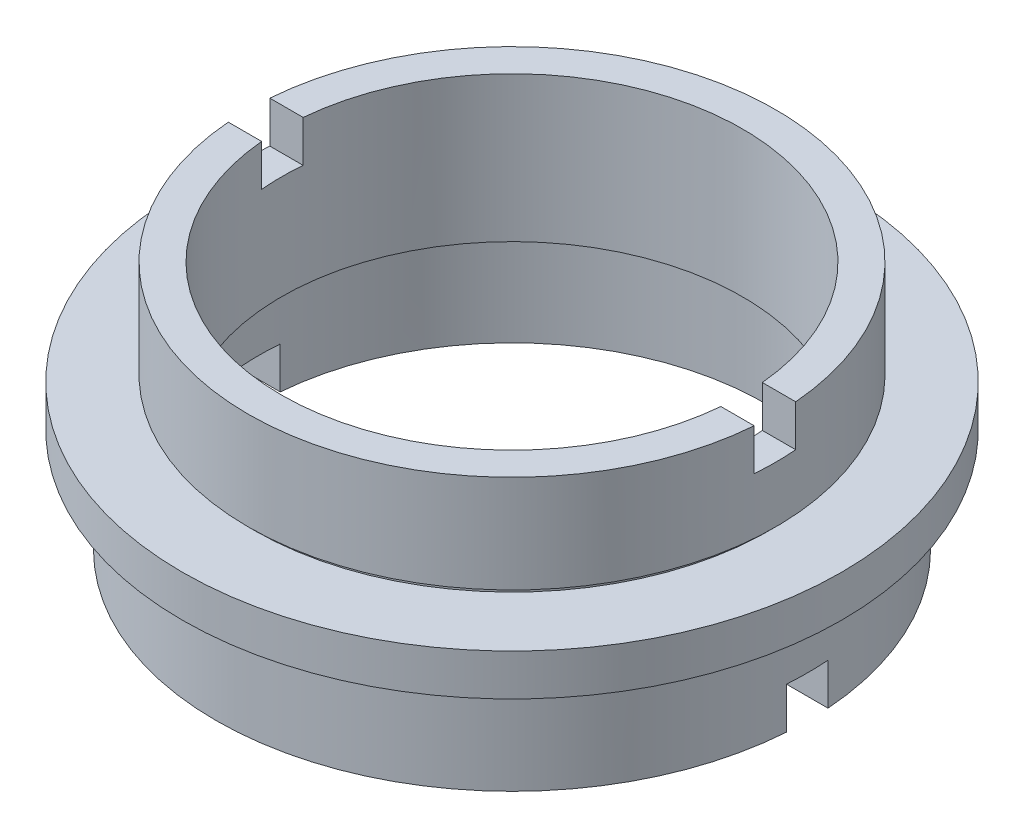
ISO-10303-21;
HEADER;
FILE_DESCRIPTION(('STEP AP214'),'2;1');
FILE_NAME('part.step','',(''),(''),'','','');
FILE_SCHEMA(('AUTOMOTIVE_DESIGN { 1 0 10303 214 1 1 1 1 }'));
ENDSEC;
DATA;
#1=APPLICATION_CONTEXT('core data for automotive mechanical design processes');
#2=APPLICATION_PROTOCOL_DEFINITION('international standard','automotive_design',2000,#1);
#3=PRODUCT_CONTEXT('',#1,'mechanical');
#4=PRODUCT('Part','Part','',(#3));
#5=PRODUCT_RELATED_PRODUCT_CATEGORY('part','',(#4));
#6=PRODUCT_DEFINITION_FORMATION('','',#4);
#7=PRODUCT_DEFINITION_CONTEXT('part definition',#1,'design');
#8=PRODUCT_DEFINITION('design','',#6,#7);
#9=PRODUCT_DEFINITION_SHAPE('','',#8);
#10=(LENGTH_UNIT() NAMED_UNIT(*) SI_UNIT(.MILLI.,.METRE.));
#11=(NAMED_UNIT(*) PLANE_ANGLE_UNIT() SI_UNIT($,.RADIAN.));
#12=(NAMED_UNIT(*) SI_UNIT($,.STERADIAN.) SOLID_ANGLE_UNIT());
#13=UNCERTAINTY_MEASURE_WITH_UNIT(LENGTH_MEASURE(1.E-05),#10,'distance_accuracy_value','');
#14=(GEOMETRIC_REPRESENTATION_CONTEXT(3) GLOBAL_UNCERTAINTY_ASSIGNED_CONTEXT((#13)) GLOBAL_UNIT_ASSIGNED_CONTEXT((#10,
#11,#12)) REPRESENTATION_CONTEXT('',''));
#15=CARTESIAN_POINT('',(0.,0.,0.));
#16=DIRECTION('',(0.,0.,1.));
#17=DIRECTION('',(1.,0.,0.));
#18=AXIS2_PLACEMENT_3D('',#15,#16,#17);
#19=CARTESIAN_POINT('',(-14.25,0.,0.));
#20=DIRECTION('',(0.,-1.,0.));
#21=DIRECTION('',(0.,0.,-1.));
#22=AXIS2_PLACEMENT_3D('',#19,#20,#21);
#23=PLANE('',#22);
#24=DIRECTION('',(-1.,0.,0.));
#25=VECTOR('',#24,1.);
#26=CARTESIAN_POINT('',(-14.25,0.,1.));
#27=LINE('',#26,#25);
#28=CARTESIAN_POINT('',(14.2148689758295,0.,1.));
#29=VERTEX_POINT('',#28);
#30=CARTESIAN_POINT('',(12.1589473228565,0.,1.));
#31=VERTEX_POINT('',#30);
#32=EDGE_CURVE('E183',#29,#31,#27,.T.);
#33=ORIENTED_EDGE('',*,*,#32,.F.);
#34=CARTESIAN_POINT('',(0.,0.,0.));
#35=DIRECTION('',(0.,1.,0.));
#36=DIRECTION('',(0.,0.,1.));
#37=AXIS2_PLACEMENT_3D('',#34,#35,#36);
#38=CIRCLE('',#37,14.25);
#39=CARTESIAN_POINT('',(-14.2148689758295,0.,1.));
#40=VERTEX_POINT('',#39);
#41=EDGE_CURVE('E238',#40,#29,#38,.T.);
#42=ORIENTED_EDGE('',*,*,#41,.F.);
#43=CARTESIAN_POINT('',(-12.1589473228565,0.,1.));
#44=VERTEX_POINT('',#43);
#45=EDGE_CURVE('E161',#44,#40,#27,.T.);
#46=ORIENTED_EDGE('',*,*,#45,.F.);
#47=CARTESIAN_POINT('',(0.,0.,0.));
#48=DIRECTION('',(0.,1.,0.));
#49=DIRECTION('',(0.,0.,1.));
#50=AXIS2_PLACEMENT_3D('',#47,#48,#49);
#51=CIRCLE('',#50,12.2);
#52=EDGE_CURVE('E234',#44,#31,#51,.T.);
#53=ORIENTED_EDGE('',*,*,#52,.T.);
#54=EDGE_LOOP('',(#33,#42,#46,#53));
#55=FACE_BOUND('',#54,.T.);
#56=ADVANCED_FACE('F38',(#55),#23,.T.);
#57=CARTESIAN_POINT('',(-11.1,12.,0.));
#58=DIRECTION('',(0.,1.,0.));
#59=DIRECTION('',(0.,0.,1.));
#60=AXIS2_PLACEMENT_3D('',#57,#58,#59);
#61=PLANE('',#60);
#62=DIRECTION('',(1.,0.,0.));
#63=VECTOR('',#62,1.);
#64=CARTESIAN_POINT('',(-11.1,12.,1.));
#65=LINE('',#64,#63);
#66=CARTESIAN_POINT('',(-12.6605687076055,12.,1.));
#67=VERTEX_POINT('',#66);
#68=CARTESIAN_POINT('',(-11.054863183233,12.,1.));
#69=VERTEX_POINT('',#68);
#70=EDGE_CURVE('E270',#67,#69,#65,.T.);
#71=ORIENTED_EDGE('',*,*,#70,.F.);
#72=CARTESIAN_POINT('',(0.,12.,0.));
#73=DIRECTION('',(0.,1.,0.));
#74=DIRECTION('',(0.,0.,1.));
#75=AXIS2_PLACEMENT_3D('',#72,#73,#74);
#76=CIRCLE('',#75,12.7);
#77=CARTESIAN_POINT('',(12.6605687076055,12.,1.));
#78=VERTEX_POINT('',#77);
#79=EDGE_CURVE('E214',#67,#78,#76,.T.);
#80=ORIENTED_EDGE('',*,*,#79,.T.);
#81=CARTESIAN_POINT('',(11.054863183233,12.,1.));
#82=VERTEX_POINT('',#81);
#83=EDGE_CURVE('E268',#82,#78,#65,.T.);
#84=ORIENTED_EDGE('',*,*,#83,.F.);
#85=CARTESIAN_POINT('',(0.,12.,0.));
#86=DIRECTION('',(0.,1.,0.));
#87=DIRECTION('',(0.,0.,1.));
#88=AXIS2_PLACEMENT_3D('',#85,#86,#87);
#89=CIRCLE('',#88,11.1);
#90=EDGE_CURVE('E218',#69,#82,#89,.T.);
#91=ORIENTED_EDGE('',*,*,#90,.F.);
#92=EDGE_LOOP('',(#71,#80,#84,#91));
#93=FACE_BOUND('',#92,.T.);
#94=ADVANCED_FACE('F319',(#93),#61,.T.);
#95=CARTESIAN_POINT('',(0.,22.6774994510759,0.));
#96=DIRECTION('',(0.,1.,0.));
#97=DIRECTION('',(0.,0.,1.));
#98=AXIS2_PLACEMENT_3D('',#95,#96,#97);
#99=CYLINDRICAL_SURFACE('',#98,12.7);
#100=DIRECTION('',(0.,1.,0.));
#101=VECTOR('',#100,1.);
#102=CARTESIAN_POINT('',(-12.6605687076055,22.6774994510759,1.));
#103=LINE('',#102,#101);
#104=CARTESIAN_POINT('',(-12.6605687076055,10.,1.));
#105=VERTEX_POINT('',#104);
#106=EDGE_CURVE('E209',#105,#67,#103,.T.);
#107=ORIENTED_EDGE('',*,*,#106,.F.);
#108=CARTESIAN_POINT('',(0.,10.,0.));
#109=DIRECTION('',(0.,-1.,0.));
#110=DIRECTION('',(0.,0.,-1.));
#111=AXIS2_PLACEMENT_3D('',#108,#109,#110);
#112=CIRCLE('',#111,12.7);
#113=CARTESIAN_POINT('',(-12.6605687076055,10.,-0.999999999999997));
#114=VERTEX_POINT('',#113);
#115=EDGE_CURVE('E213',#114,#105,#112,.F.);
#116=ORIENTED_EDGE('',*,*,#115,.F.);
#117=DIRECTION('',(0.,1.,0.));
#118=VECTOR('',#117,1.);
#119=CARTESIAN_POINT('',(-12.6605687076055,22.6774994510759,-1.));
#120=LINE('',#119,#118);
#121=CARTESIAN_POINT('',(-12.6605687076055,12.,-0.999999999999998));
#122=VERTEX_POINT('',#121);
#123=EDGE_CURVE('E197',#122,#114,#120,.F.);
#124=ORIENTED_EDGE('',*,*,#123,.F.);
#125=CARTESIAN_POINT('',(12.6605687076055,12.,-0.999999999999998));
#126=VERTEX_POINT('',#125);
#127=EDGE_CURVE('E217',#126,#122,#76,.T.);
#128=ORIENTED_EDGE('',*,*,#127,.F.);
#129=DIRECTION('',(0.,1.,0.));
#130=VECTOR('',#129,1.);
#131=CARTESIAN_POINT('',(12.6605687076055,22.6774994510759,-1.));
#132=LINE('',#131,#130);
#133=CARTESIAN_POINT('',(12.6605687076055,10.,-0.999999999999997));
#134=VERTEX_POINT('',#133);
#135=EDGE_CURVE('E201',#134,#126,#132,.T.);
#136=ORIENTED_EDGE('',*,*,#135,.F.);
#137=CARTESIAN_POINT('',(12.6605687076055,10.,1.));
#138=VERTEX_POINT('',#137);
#139=EDGE_CURVE('E211',#138,#134,#112,.F.);
#140=ORIENTED_EDGE('',*,*,#139,.F.);
#141=DIRECTION('',(0.,1.,0.));
#142=VECTOR('',#141,1.);
#143=CARTESIAN_POINT('',(12.6605687076055,22.6774994510759,1.));
#144=LINE('',#143,#142);
#145=EDGE_CURVE('E205',#78,#138,#144,.F.);
#146=ORIENTED_EDGE('',*,*,#145,.F.);
#147=ORIENTED_EDGE('',*,*,#79,.F.);
#148=EDGE_LOOP('',(#107,#116,#124,#128,#136,#140,#146,#147));
#149=FACE_BOUND('',#148,.T.);
#150=CARTESIAN_POINT('',(0.,7.3,0.));
#151=DIRECTION('',(0.,1.,0.));
#152=DIRECTION('',(0.,0.,1.));
#153=AXIS2_PLACEMENT_3D('',#150,#151,#152);
#154=CIRCLE('',#153,12.7);
#155=CARTESIAN_POINT('',(0.,7.3,12.7));
#156=VERTEX_POINT('',#155);
#157=EDGE_CURVE('E262',#156,#156,#154,.T.);
#158=ORIENTED_EDGE('',*,*,#157,.T.);
#159=EDGE_LOOP('',(#158));
#160=FACE_BOUND('',#159,.T.);
#161=ADVANCED_FACE('F40',(#149,#160),#99,.T.);
#162=CARTESIAN_POINT('',(-12.7,7.3,0.));
#163=DIRECTION('',(0.,-1.,0.));
#164=DIRECTION('',(0.,0.,-1.));
#165=AXIS2_PLACEMENT_3D('',#162,#163,#164);
#166=PLANE('',#165);
#167=CARTESIAN_POINT('',(0.,7.3,0.));
#168=DIRECTION('',(0.,1.,0.));
#169=DIRECTION('',(0.,0.,1.));
#170=AXIS2_PLACEMENT_3D('',#167,#168,#169);
#171=CIRCLE('',#170,12.4);
#172=CARTESIAN_POINT('',(0.,7.3,12.4));
#173=VERTEX_POINT('',#172);
#174=EDGE_CURVE('E259',#173,#173,#171,.T.);
#175=ORIENTED_EDGE('',*,*,#174,.T.);
#176=EDGE_LOOP('',(#175));
#177=FACE_BOUND('',#176,.T.);
#178=ORIENTED_EDGE('',*,*,#157,.F.);
#179=EDGE_LOOP('',(#178));
#180=FACE_BOUND('',#179,.T.);
#181=ADVANCED_FACE('F329',(#177,#180),#166,.T.);
#182=CARTESIAN_POINT('',(0.,22.6774994510759,0.));
#183=DIRECTION('',(0.,1.,0.));
#184=DIRECTION('',(0.,0.,1.));
#185=AXIS2_PLACEMENT_3D('',#182,#183,#184);
#186=CYLINDRICAL_SURFACE('',#185,12.4);
#187=CARTESIAN_POINT('',(0.,7.,0.));
#188=DIRECTION('',(0.,1.,0.));
#189=DIRECTION('',(0.,0.,1.));
#190=AXIS2_PLACEMENT_3D('',#187,#188,#189);
#191=CIRCLE('',#190,12.4);
#192=CARTESIAN_POINT('',(0.,7.,12.4));
#193=VERTEX_POINT('',#192);
#194=EDGE_CURVE('E256',#193,#193,#191,.T.);
#195=ORIENTED_EDGE('',*,*,#194,.T.);
#196=EDGE_LOOP('',(#195));
#197=FACE_BOUND('',#196,.T.);
#198=ORIENTED_EDGE('',*,*,#174,.F.);
#199=EDGE_LOOP('',(#198));
#200=FACE_BOUND('',#199,.T.);
#201=ADVANCED_FACE('F569',(#197,#200),#186,.T.);
#202=CARTESIAN_POINT('',(-12.4,7.,0.));
#203=DIRECTION('',(0.,1.,0.));
#204=DIRECTION('',(0.,0.,1.));
#205=AXIS2_PLACEMENT_3D('',#202,#203,#204);
#206=PLANE('',#205);
#207=CARTESIAN_POINT('',(0.,7.,0.));
#208=DIRECTION('',(0.,1.,0.));
#209=DIRECTION('',(0.,0.,1.));
#210=AXIS2_PLACEMENT_3D('',#207,#208,#209);
#211=CIRCLE('',#210,15.875);
#212=CARTESIAN_POINT('',(0.,7.,15.875));
#213=VERTEX_POINT('',#212);
#214=EDGE_CURVE('E253',#213,#213,#211,.T.);
#215=ORIENTED_EDGE('',*,*,#214,.T.);
#216=EDGE_LOOP('',(#215));
#217=FACE_BOUND('',#216,.T.);
#218=ORIENTED_EDGE('',*,*,#194,.F.);
#219=EDGE_LOOP('',(#218));
#220=FACE_BOUND('',#219,.T.);
#221=ADVANCED_FACE('F560',(#217,#220),#206,.T.);
#222=CARTESIAN_POINT('',(0.,22.6774994510759,0.));
#223=DIRECTION('',(0.,1.,0.));
#224=DIRECTION('',(0.,0.,1.));
#225=AXIS2_PLACEMENT_3D('',#222,#223,#224);
#226=CYLINDRICAL_SURFACE('',#225,15.875);
#227=CARTESIAN_POINT('',(0.,5.,0.));
#228=DIRECTION('',(0.,1.,0.));
#229=DIRECTION('',(0.,0.,1.));
#230=AXIS2_PLACEMENT_3D('',#227,#228,#229);
#231=CIRCLE('',#230,15.875);
#232=CARTESIAN_POINT('',(0.,5.,15.875));
#233=VERTEX_POINT('',#232);
#234=EDGE_CURVE('E250',#233,#233,#231,.T.);
#235=ORIENTED_EDGE('',*,*,#234,.T.);
#236=EDGE_LOOP('',(#235));
#237=FACE_BOUND('',#236,.T.);
#238=ORIENTED_EDGE('',*,*,#214,.F.);
#239=EDGE_LOOP('',(#238));
#240=FACE_BOUND('',#239,.T.);
#241=ADVANCED_FACE('F551',(#237,#240),#226,.T.);
#242=CARTESIAN_POINT('',(-15.875,5.,0.));
#243=DIRECTION('',(0.,-1.,0.));
#244=DIRECTION('',(0.,0.,-1.));
#245=AXIS2_PLACEMENT_3D('',#242,#243,#244);
#246=PLANE('',#245);
#247=CARTESIAN_POINT('',(0.,5.,0.));
#248=DIRECTION('',(0.,1.,0.));
#249=DIRECTION('',(0.,0.,1.));
#250=AXIS2_PLACEMENT_3D('',#247,#248,#249);
#251=CIRCLE('',#250,13.75);
#252=CARTESIAN_POINT('',(0.,5.,13.75));
#253=VERTEX_POINT('',#252);
#254=EDGE_CURVE('E247',#253,#253,#251,.T.);
#255=ORIENTED_EDGE('',*,*,#254,.T.);
#256=EDGE_LOOP('',(#255));
#257=FACE_BOUND('',#256,.T.);
#258=ORIENTED_EDGE('',*,*,#234,.F.);
#259=EDGE_LOOP('',(#258));
#260=FACE_BOUND('',#259,.T.);
#261=ADVANCED_FACE('F542',(#257,#260),#246,.T.);
#262=CARTESIAN_POINT('',(0.,22.6774994510759,0.));
#263=DIRECTION('',(0.,1.,0.));
#264=DIRECTION('',(0.,0.,1.));
#265=AXIS2_PLACEMENT_3D('',#262,#263,#264);
#266=CYLINDRICAL_SURFACE('',#265,13.75);
#267=CARTESIAN_POINT('',(0.,4.,0.));
#268=DIRECTION('',(0.,1.,0.));
#269=DIRECTION('',(0.,0.,1.));
#270=AXIS2_PLACEMENT_3D('',#267,#268,#269);
#271=CIRCLE('',#270,13.75);
#272=CARTESIAN_POINT('',(0.,4.,13.75));
#273=VERTEX_POINT('',#272);
#274=EDGE_CURVE('E244',#273,#273,#271,.T.);
#275=ORIENTED_EDGE('',*,*,#274,.T.);
#276=EDGE_LOOP('',(#275));
#277=FACE_BOUND('',#276,.T.);
#278=ORIENTED_EDGE('',*,*,#254,.F.);
#279=EDGE_LOOP('',(#278));
#280=FACE_BOUND('',#279,.T.);
#281=ADVANCED_FACE('F533',(#277,#280),#266,.T.);
#282=CARTESIAN_POINT('',(-13.75,4.,0.));
#283=DIRECTION('',(0.,1.,0.));
#284=DIRECTION('',(0.,0.,1.));
#285=AXIS2_PLACEMENT_3D('',#282,#283,#284);
#286=PLANE('',#285);
#287=CARTESIAN_POINT('',(0.,4.,0.));
#288=DIRECTION('',(0.,1.,0.));
#289=DIRECTION('',(0.,0.,1.));
#290=AXIS2_PLACEMENT_3D('',#287,#288,#289);
#291=CIRCLE('',#290,14.25);
#292=CARTESIAN_POINT('',(0.,4.,14.25));
#293=VERTEX_POINT('',#292);
#294=EDGE_CURVE('E241',#293,#293,#291,.T.);
#295=ORIENTED_EDGE('',*,*,#294,.T.);
#296=EDGE_LOOP('',(#295));
#297=FACE_BOUND('',#296,.T.);
#298=ORIENTED_EDGE('',*,*,#274,.F.);
#299=EDGE_LOOP('',(#298));
#300=FACE_BOUND('',#299,.T.);
#301=ADVANCED_FACE('F316',(#297,#300),#286,.T.);
#302=CARTESIAN_POINT('',(0.,22.6774994510759,0.));
#303=DIRECTION('',(0.,1.,0.));
#304=DIRECTION('',(0.,0.,1.));
#305=AXIS2_PLACEMENT_3D('',#302,#303,#304);
#306=CYLINDRICAL_SURFACE('',#305,14.25);
#307=DIRECTION('',(0.,1.,0.));
#308=VECTOR('',#307,1.);
#309=CARTESIAN_POINT('',(-14.2148689758295,22.6774994510759,1.));
#310=LINE('',#309,#308);
#311=CARTESIAN_POINT('',(-14.2148689758295,2.,1.));
#312=VERTEX_POINT('',#311);
#313=EDGE_CURVE('E182',#40,#312,#310,.T.);
#314=ORIENTED_EDGE('',*,*,#313,.F.);
#315=ORIENTED_EDGE('',*,*,#41,.T.);
#316=DIRECTION('',(0.,1.,0.));
#317=VECTOR('',#316,1.);
#318=CARTESIAN_POINT('',(14.2148689758295,22.6774994510759,1.));
#319=LINE('',#318,#317);
#320=CARTESIAN_POINT('',(14.2148689758295,2.,1.));
#321=VERTEX_POINT('',#320);
#322=EDGE_CURVE('E185',#321,#29,#319,.F.);
#323=ORIENTED_EDGE('',*,*,#322,.F.);
#324=CARTESIAN_POINT('',(0.,2.,0.));
#325=DIRECTION('',(0.,1.,0.));
#326=DIRECTION('',(0.,0.,1.));
#327=AXIS2_PLACEMENT_3D('',#324,#325,#326);
#328=CIRCLE('',#327,14.25);
#329=CARTESIAN_POINT('',(14.2148689758295,2.,-1.));
#330=VERTEX_POINT('',#329);
#331=EDGE_CURVE('E162',#330,#321,#328,.F.);
#332=ORIENTED_EDGE('',*,*,#331,.F.);
#333=DIRECTION('',(0.,1.,0.));
#334=VECTOR('',#333,1.);
#335=CARTESIAN_POINT('',(14.2148689758295,22.6774994510759,-0.999999999999994));
#336=LINE('',#335,#334);
#337=CARTESIAN_POINT('',(14.2148689758295,0.,-1.));
#338=VERTEX_POINT('',#337);
#339=EDGE_CURVE('E176',#338,#330,#336,.T.);
#340=ORIENTED_EDGE('',*,*,#339,.F.);
#341=CARTESIAN_POINT('',(-14.2148689758295,0.,-1.));
#342=VERTEX_POINT('',#341);
#343=EDGE_CURVE('E174',#338,#342,#38,.T.);
#344=ORIENTED_EDGE('',*,*,#343,.T.);
#345=DIRECTION('',(0.,1.,0.));
#346=VECTOR('',#345,1.);
#347=CARTESIAN_POINT('',(-14.2148689758295,22.6774994510759,-0.999999999999994));
#348=LINE('',#347,#346);
#349=CARTESIAN_POINT('',(-14.2148689758295,2.,-1.));
#350=VERTEX_POINT('',#349);
#351=EDGE_CURVE('E165',#350,#342,#348,.F.);
#352=ORIENTED_EDGE('',*,*,#351,.F.);
#353=EDGE_CURVE('E151',#312,#350,#328,.F.);
#354=ORIENTED_EDGE('',*,*,#353,.F.);
#355=EDGE_LOOP('',(#314,#315,#323,#332,#340,#344,#352,#354));
#356=FACE_BOUND('',#355,.T.);
#357=ORIENTED_EDGE('',*,*,#294,.F.);
#358=EDGE_LOOP('',(#357));
#359=FACE_BOUND('',#358,.T.);
#360=ADVANCED_FACE('F170',(#356,#359),#306,.T.);
#361=DIRECTION('',(1.,0.,0.));
#362=VECTOR('',#361,1.);
#363=CARTESIAN_POINT('',(-14.25,0.,-1.));
#364=LINE('',#363,#362);
#365=CARTESIAN_POINT('',(-12.1589473228565,0.,-0.999999999999995));
#366=VERTEX_POINT('',#365);
#367=EDGE_CURVE('E61',#342,#366,#364,.T.);
#368=ORIENTED_EDGE('',*,*,#367,.F.);
#369=ORIENTED_EDGE('',*,*,#343,.F.);
#370=CARTESIAN_POINT('',(12.1589473228565,0.,-0.999999999999994));
#371=VERTEX_POINT('',#370);
#372=EDGE_CURVE('E178',#371,#338,#364,.T.);
#373=ORIENTED_EDGE('',*,*,#372,.F.);
#374=EDGE_CURVE('E237',#371,#366,#51,.T.);
#375=ORIENTED_EDGE('',*,*,#374,.T.);
#376=EDGE_LOOP('',(#368,#369,#373,#375));
#377=FACE_BOUND('',#376,.T.);
#378=ADVANCED_FACE('F307',(#377),#23,.T.);
#379=CARTESIAN_POINT('',(0.,22.6774994510759,0.));
#380=DIRECTION('',(0.,1.,0.));
#381=DIRECTION('',(0.,0.,1.));
#382=AXIS2_PLACEMENT_3D('',#379,#380,#381);
#383=CYLINDRICAL_SURFACE('',#382,12.2);
#384=DIRECTION('',(0.,1.,0.));
#385=VECTOR('',#384,1.);
#386=CARTESIAN_POINT('',(-12.1589473228565,22.6774994510759,1.));
#387=LINE('',#386,#385);
#388=CARTESIAN_POINT('',(-12.1589473228565,2.,1.));
#389=VERTEX_POINT('',#388);
#390=EDGE_CURVE('E12',#389,#44,#387,.F.);
#391=ORIENTED_EDGE('',*,*,#390,.F.);
#392=CARTESIAN_POINT('',(0.,2.,0.));
#393=DIRECTION('',(0.,1.,0.));
#394=DIRECTION('',(0.,0.,1.));
#395=AXIS2_PLACEMENT_3D('',#392,#393,#394);
#396=CIRCLE('',#395,12.2);
#397=CARTESIAN_POINT('',(-12.1589473228565,2.,-1.));
#398=VERTEX_POINT('',#397);
#399=EDGE_CURVE('E46',#398,#389,#396,.T.);
#400=ORIENTED_EDGE('',*,*,#399,.F.);
#401=DIRECTION('',(0.,1.,0.));
#402=VECTOR('',#401,1.);
#403=CARTESIAN_POINT('',(-12.1589473228565,22.6774994510759,-0.999999999999994));
#404=LINE('',#403,#402);
#405=EDGE_CURVE('E166',#366,#398,#404,.T.);
#406=ORIENTED_EDGE('',*,*,#405,.F.);
#407=ORIENTED_EDGE('',*,*,#374,.F.);
#408=DIRECTION('',(0.,1.,0.));
#409=VECTOR('',#408,1.);
#410=CARTESIAN_POINT('',(12.1589473228565,22.6774994510759,-0.999999999999994));
#411=LINE('',#410,#409);
#412=CARTESIAN_POINT('',(12.1589473228565,2.,-0.999999999999994));
#413=VERTEX_POINT('',#412);
#414=EDGE_CURVE('E274',#413,#371,#411,.F.);
#415=ORIENTED_EDGE('',*,*,#414,.F.);
#416=CARTESIAN_POINT('',(12.1589473228565,2.,1.));
#417=VERTEX_POINT('',#416);
#418=EDGE_CURVE('E276',#417,#413,#396,.T.);
#419=ORIENTED_EDGE('',*,*,#418,.F.);
#420=DIRECTION('',(0.,1.,0.));
#421=VECTOR('',#420,1.);
#422=CARTESIAN_POINT('',(12.1589473228565,22.6774994510759,1.));
#423=LINE('',#422,#421);
#424=EDGE_CURVE('E278',#31,#417,#423,.T.);
#425=ORIENTED_EDGE('',*,*,#424,.F.);
#426=ORIENTED_EDGE('',*,*,#52,.F.);
#427=EDGE_LOOP('',(#391,#400,#406,#407,#415,#419,#425,#426));
#428=FACE_BOUND('',#427,.T.);
#429=CARTESIAN_POINT('',(0.,4.7,0.));
#430=DIRECTION('',(0.,1.,0.));
#431=DIRECTION('',(0.,0.,1.));
#432=AXIS2_PLACEMENT_3D('',#429,#430,#431);
#433=CIRCLE('',#432,12.2);
#434=CARTESIAN_POINT('',(0.,4.7,12.2));
#435=VERTEX_POINT('',#434);
#436=EDGE_CURVE('E231',#435,#435,#433,.T.);
#437=ORIENTED_EDGE('',*,*,#436,.T.);
#438=EDGE_LOOP('',(#437));
#439=FACE_BOUND('',#438,.T.);
#440=ADVANCED_FACE('F286',(#428,#439),#383,.F.);
#441=CARTESIAN_POINT('',(-12.7,4.7,0.));
#442=DIRECTION('',(0.,1.,0.));
#443=DIRECTION('',(0.,0.,1.));
#444=AXIS2_PLACEMENT_3D('',#441,#442,#443);
#445=PLANE('',#444);
#446=CARTESIAN_POINT('',(0.,4.7,0.));
#447=DIRECTION('',(0.,1.,0.));
#448=DIRECTION('',(0.,0.,1.));
#449=AXIS2_PLACEMENT_3D('',#446,#447,#448);
#450=CIRCLE('',#449,12.7);
#451=CARTESIAN_POINT('',(0.,4.7,12.7));
#452=VERTEX_POINT('',#451);
#453=EDGE_CURVE('E228',#452,#452,#450,.T.);
#454=ORIENTED_EDGE('',*,*,#453,.T.);
#455=EDGE_LOOP('',(#454));
#456=FACE_BOUND('',#455,.T.);
#457=ORIENTED_EDGE('',*,*,#436,.F.);
#458=EDGE_LOOP('',(#457));
#459=FACE_BOUND('',#458,.T.);
#460=ADVANCED_FACE('F314',(#456,#459),#445,.T.);
#461=CARTESIAN_POINT('',(0.,22.6774994510759,0.));
#462=DIRECTION('',(0.,1.,0.));
#463=DIRECTION('',(0.,0.,1.));
#464=AXIS2_PLACEMENT_3D('',#461,#462,#463);
#465=CYLINDRICAL_SURFACE('',#464,12.7);
#466=CARTESIAN_POINT('',(0.,5.,0.));
#467=DIRECTION('',(0.,1.,0.));
#468=DIRECTION('',(0.,0.,1.));
#469=AXIS2_PLACEMENT_3D('',#466,#467,#468);
#470=CIRCLE('',#469,12.7);
#471=CARTESIAN_POINT('',(0.,5.,12.7));
#472=VERTEX_POINT('',#471);
#473=EDGE_CURVE('E225',#472,#472,#470,.T.);
#474=ORIENTED_EDGE('',*,*,#473,.T.);
#475=EDGE_LOOP('',(#474));
#476=FACE_BOUND('',#475,.T.);
#477=ORIENTED_EDGE('',*,*,#453,.F.);
#478=EDGE_LOOP('',(#477));
#479=FACE_BOUND('',#478,.T.);
#480=ADVANCED_FACE('F492',(#476,#479),#465,.F.);
#481=CARTESIAN_POINT('',(-11.1,5.,0.));
#482=DIRECTION('',(0.,-1.,0.));
#483=DIRECTION('',(0.,0.,-1.));
#484=AXIS2_PLACEMENT_3D('',#481,#482,#483);
#485=PLANE('',#484);
#486=CARTESIAN_POINT('',(0.,5.,0.));
#487=DIRECTION('',(0.,1.,0.));
#488=DIRECTION('',(0.,0.,1.));
#489=AXIS2_PLACEMENT_3D('',#486,#487,#488);
#490=CIRCLE('',#489,11.1);
#491=CARTESIAN_POINT('',(0.,5.,11.1));
#492=VERTEX_POINT('',#491);
#493=EDGE_CURVE('E222',#492,#492,#490,.T.);
#494=ORIENTED_EDGE('',*,*,#493,.T.);
#495=EDGE_LOOP('',(#494));
#496=FACE_BOUND('',#495,.T.);
#497=ORIENTED_EDGE('',*,*,#473,.F.);
#498=EDGE_LOOP('',(#497));
#499=FACE_BOUND('',#498,.T.);
#500=ADVANCED_FACE('F345',(#496,#499),#485,.T.);
#501=CARTESIAN_POINT('',(0.,22.6774994510759,0.));
#502=DIRECTION('',(0.,1.,0.));
#503=DIRECTION('',(0.,0.,1.));
#504=AXIS2_PLACEMENT_3D('',#501,#502,#503);
#505=CYLINDRICAL_SURFACE('',#504,11.1);
#506=DIRECTION('',(0.,1.,0.));
#507=VECTOR('',#506,1.);
#508=CARTESIAN_POINT('',(11.054863183233,22.6774994510759,1.));
#509=LINE('',#508,#507);
#510=CARTESIAN_POINT('',(11.054863183233,10.,1.));
#511=VERTEX_POINT('',#510);
#512=EDGE_CURVE('E203',#511,#82,#509,.T.);
#513=ORIENTED_EDGE('',*,*,#512,.F.);
#514=CARTESIAN_POINT('',(0.,10.,0.));
#515=DIRECTION('',(0.,-1.,0.));
#516=DIRECTION('',(0.,0.,-1.));
#517=AXIS2_PLACEMENT_3D('',#514,#515,#516);
#518=CIRCLE('',#517,11.1);
#519=CARTESIAN_POINT('',(11.054863183233,10.,-0.999999999999997));
#520=VERTEX_POINT('',#519);
#521=EDGE_CURVE('E273',#520,#511,#518,.T.);
#522=ORIENTED_EDGE('',*,*,#521,.F.);
#523=DIRECTION('',(0.,1.,0.));
#524=VECTOR('',#523,1.);
#525=CARTESIAN_POINT('',(11.054863183233,22.6774994510759,-1.));
#526=LINE('',#525,#524);
#527=CARTESIAN_POINT('',(11.054863183233,12.,-0.999999999999998));
#528=VERTEX_POINT('',#527);
#529=EDGE_CURVE('E199',#528,#520,#526,.F.);
#530=ORIENTED_EDGE('',*,*,#529,.F.);
#531=CARTESIAN_POINT('',(-11.054863183233,12.,-0.999999999999998));
#532=VERTEX_POINT('',#531);
#533=EDGE_CURVE('E221',#528,#532,#89,.T.);
#534=ORIENTED_EDGE('',*,*,#533,.T.);
#535=DIRECTION('',(0.,1.,0.));
#536=VECTOR('',#535,1.);
#537=CARTESIAN_POINT('',(-11.054863183233,22.6774994510759,-1.));
#538=LINE('',#537,#536);
#539=CARTESIAN_POINT('',(-11.054863183233,10.,-0.999999999999997));
#540=VERTEX_POINT('',#539);
#541=EDGE_CURVE('E195',#540,#532,#538,.T.);
#542=ORIENTED_EDGE('',*,*,#541,.F.);
#543=CARTESIAN_POINT('',(-11.054863183233,10.,1.));
#544=VERTEX_POINT('',#543);
#545=EDGE_CURVE('E271',#544,#540,#518,.T.);
#546=ORIENTED_EDGE('',*,*,#545,.F.);
#547=DIRECTION('',(0.,1.,0.));
#548=VECTOR('',#547,1.);
#549=CARTESIAN_POINT('',(-11.054863183233,22.6774994510759,1.));
#550=LINE('',#549,#548);
#551=EDGE_CURVE('E207',#69,#544,#550,.F.);
#552=ORIENTED_EDGE('',*,*,#551,.F.);
#553=ORIENTED_EDGE('',*,*,#90,.T.);
#554=EDGE_LOOP('',(#513,#522,#530,#534,#542,#546,#552,#553));
#555=FACE_BOUND('',#554,.T.);
#556=ORIENTED_EDGE('',*,*,#493,.F.);
#557=EDGE_LOOP('',(#556));
#558=FACE_BOUND('',#557,.T.);
#559=ADVANCED_FACE('F336',(#555,#558),#505,.F.);
#560=DIRECTION('',(-1.,0.,0.));
#561=VECTOR('',#560,1.);
#562=CARTESIAN_POINT('',(-11.1,12.,-0.999999999999998));
#563=LINE('',#562,#561);
#564=EDGE_CURVE('E267',#126,#528,#563,.T.);
#565=ORIENTED_EDGE('',*,*,#564,.F.);
#566=ORIENTED_EDGE('',*,*,#127,.T.);
#567=EDGE_CURVE('E265',#532,#122,#563,.T.);
#568=ORIENTED_EDGE('',*,*,#567,.F.);
#569=ORIENTED_EDGE('',*,*,#533,.F.);
#570=EDGE_LOOP('',(#565,#566,#568,#569));
#571=FACE_BOUND('',#570,.T.);
#572=ADVANCED_FACE('F325',(#571),#61,.T.);
#573=CARTESIAN_POINT('',(-39.5,13.5939878717808,1.));
#574=DIRECTION('',(0.,0.,1.));
#575=DIRECTION('',(0.,-1.,0.));
#576=AXIS2_PLACEMENT_3D('',#573,#574,#575);
#577=PLANE('',#576);
#578=ORIENTED_EDGE('',*,*,#106,.T.);
#579=ORIENTED_EDGE('',*,*,#70,.T.);
#580=ORIENTED_EDGE('',*,*,#551,.T.);
#581=DIRECTION('',(1.,0.,0.));
#582=VECTOR('',#581,1.);
#583=CARTESIAN_POINT('',(-39.5,10.,1.));
#584=LINE('',#583,#582);
#585=EDGE_CURVE('E192',#105,#544,#584,.T.);
#586=ORIENTED_EDGE('',*,*,#585,.F.);
#587=EDGE_LOOP('',(#578,#579,#580,#586));
#588=FACE_BOUND('',#587,.T.);
#589=ADVANCED_FACE('F335',(#588),#577,.F.);
#590=CARTESIAN_POINT('',(-39.5,13.5939878717808,-0.999999999999998));
#591=DIRECTION('',(0.,0.,-1.));
#592=DIRECTION('',(0.,1.,0.));
#593=AXIS2_PLACEMENT_3D('',#590,#591,#592);
#594=PLANE('',#593);
#595=ORIENTED_EDGE('',*,*,#123,.T.);
#596=DIRECTION('',(1.,0.,0.));
#597=VECTOR('',#596,1.);
#598=CARTESIAN_POINT('',(-39.5,10.,-0.999999999999997));
#599=LINE('',#598,#597);
#600=EDGE_CURVE('E191',#114,#540,#599,.T.);
#601=ORIENTED_EDGE('',*,*,#600,.T.);
#602=ORIENTED_EDGE('',*,*,#541,.T.);
#603=ORIENTED_EDGE('',*,*,#567,.T.);
#604=EDGE_LOOP('',(#595,#601,#602,#603));
#605=FACE_BOUND('',#604,.T.);
#606=ADVANCED_FACE('F342',(#605),#594,.F.);
#607=CARTESIAN_POINT('',(-39.5,10.,1.));
#608=DIRECTION('',(0.,-1.,0.));
#609=DIRECTION('',(0.,0.,-1.));
#610=AXIS2_PLACEMENT_3D('',#607,#608,#609);
#611=PLANE('',#610);
#612=ORIENTED_EDGE('',*,*,#115,.T.);
#613=ORIENTED_EDGE('',*,*,#585,.T.);
#614=ORIENTED_EDGE('',*,*,#545,.T.);
#615=ORIENTED_EDGE('',*,*,#600,.F.);
#616=EDGE_LOOP('',(#612,#613,#614,#615));
#617=FACE_BOUND('',#616,.T.);
#618=ADVANCED_FACE('F366',(#617),#611,.F.);
#619=ORIENTED_EDGE('',*,*,#139,.T.);
#620=EDGE_CURVE('E188',#520,#134,#599,.T.);
#621=ORIENTED_EDGE('',*,*,#620,.F.);
#622=ORIENTED_EDGE('',*,*,#521,.T.);
#623=EDGE_CURVE('E187',#511,#138,#584,.T.);
#624=ORIENTED_EDGE('',*,*,#623,.T.);
#625=EDGE_LOOP('',(#619,#621,#622,#624));
#626=FACE_BOUND('',#625,.T.);
#627=ADVANCED_FACE('F378',(#626),#611,.F.);
#628=ORIENTED_EDGE('',*,*,#135,.T.);
#629=ORIENTED_EDGE('',*,*,#564,.T.);
#630=ORIENTED_EDGE('',*,*,#529,.T.);
#631=ORIENTED_EDGE('',*,*,#620,.T.);
#632=EDGE_LOOP('',(#628,#629,#630,#631));
#633=FACE_BOUND('',#632,.T.);
#634=ADVANCED_FACE('F376',(#633),#594,.F.);
#635=ORIENTED_EDGE('',*,*,#145,.T.);
#636=ORIENTED_EDGE('',*,*,#623,.F.);
#637=ORIENTED_EDGE('',*,*,#512,.T.);
#638=ORIENTED_EDGE('',*,*,#83,.T.);
#639=EDGE_LOOP('',(#635,#636,#637,#638));
#640=FACE_BOUND('',#639,.T.);
#641=ADVANCED_FACE('F344',(#640),#577,.F.);
#642=CARTESIAN_POINT('',(-39.5,2.,-1.));
#643=DIRECTION('',(0.,0.,-1.));
#644=DIRECTION('',(0.,1.,0.));
#645=AXIS2_PLACEMENT_3D('',#642,#643,#644);
#646=PLANE('',#645);
#647=ORIENTED_EDGE('',*,*,#339,.T.);
#648=DIRECTION('',(1.,0.,0.));
#649=VECTOR('',#648,1.);
#650=CARTESIAN_POINT('',(-39.5,2.,-1.));
#651=LINE('',#650,#649);
#652=EDGE_CURVE('E53',#413,#330,#651,.T.);
#653=ORIENTED_EDGE('',*,*,#652,.F.);
#654=ORIENTED_EDGE('',*,*,#414,.T.);
#655=ORIENTED_EDGE('',*,*,#372,.T.);
#656=EDGE_LOOP('',(#647,#653,#654,#655));
#657=FACE_BOUND('',#656,.T.);
#658=ADVANCED_FACE('F301',(#657),#646,.F.);
#659=CARTESIAN_POINT('',(-39.5,2.,1.));
#660=DIRECTION('',(0.,1.,0.));
#661=DIRECTION('',(0.,0.,1.));
#662=AXIS2_PLACEMENT_3D('',#659,#660,#661);
#663=PLANE('',#662);
#664=ORIENTED_EDGE('',*,*,#331,.T.);
#665=DIRECTION('',(1.,0.,0.));
#666=VECTOR('',#665,1.);
#667=CARTESIAN_POINT('',(-39.5,2.,1.));
#668=LINE('',#667,#666);
#669=EDGE_CURVE('E167',#417,#321,#668,.T.);
#670=ORIENTED_EDGE('',*,*,#669,.F.);
#671=ORIENTED_EDGE('',*,*,#418,.T.);
#672=ORIENTED_EDGE('',*,*,#652,.T.);
#673=EDGE_LOOP('',(#664,#670,#671,#672));
#674=FACE_BOUND('',#673,.T.);
#675=ADVANCED_FACE('F302',(#674),#663,.F.);
#676=CARTESIAN_POINT('',(-39.5,2.,1.));
#677=DIRECTION('',(0.,0.,1.));
#678=DIRECTION('',(0.,-1.,0.));
#679=AXIS2_PLACEMENT_3D('',#676,#677,#678);
#680=PLANE('',#679);
#681=ORIENTED_EDGE('',*,*,#322,.T.);
#682=ORIENTED_EDGE('',*,*,#32,.T.);
#683=ORIENTED_EDGE('',*,*,#424,.T.);
#684=ORIENTED_EDGE('',*,*,#669,.T.);
#685=EDGE_LOOP('',(#681,#682,#683,#684));
#686=FACE_BOUND('',#685,.T.);
#687=ADVANCED_FACE('F297',(#686),#680,.F.);
#688=ORIENTED_EDGE('',*,*,#351,.T.);
#689=ORIENTED_EDGE('',*,*,#367,.T.);
#690=ORIENTED_EDGE('',*,*,#405,.T.);
#691=EDGE_CURVE('E154',#350,#398,#651,.T.);
#692=ORIENTED_EDGE('',*,*,#691,.F.);
#693=EDGE_LOOP('',(#688,#689,#690,#692));
#694=FACE_BOUND('',#693,.T.);
#695=ADVANCED_FACE('F164',(#694),#646,.F.);
#696=ORIENTED_EDGE('',*,*,#313,.T.);
#697=EDGE_CURVE('E157',#312,#389,#668,.T.);
#698=ORIENTED_EDGE('',*,*,#697,.T.);
#699=ORIENTED_EDGE('',*,*,#390,.T.);
#700=ORIENTED_EDGE('',*,*,#45,.T.);
#701=EDGE_LOOP('',(#696,#698,#699,#700));
#702=FACE_BOUND('',#701,.T.);
#703=ADVANCED_FACE('F282',(#702),#680,.F.);
#704=ORIENTED_EDGE('',*,*,#353,.T.);
#705=ORIENTED_EDGE('',*,*,#691,.T.);
#706=ORIENTED_EDGE('',*,*,#399,.T.);
#707=ORIENTED_EDGE('',*,*,#697,.F.);
#708=EDGE_LOOP('',(#704,#705,#706,#707));
#709=FACE_BOUND('',#708,.T.);
#710=ADVANCED_FACE('F153',(#709),#663,.F.);
#711=CLOSED_SHELL('',(#56,#94,#161,#181,#201,#221,#241,#261,#281,#301,#360,#378,#440,#460,#480,
#500,#559,#572,#589,#606,#618,#627,#634,#641,#658,#675,#687,#695,#703,#710));
#712=MANIFOLD_SOLID_BREP('B2',#711);
#713=ADVANCED_BREP_SHAPE_REPRESENTATION('',(#18,#712),#14);
#714=SHAPE_DEFINITION_REPRESENTATION(#9,#713);
ENDSEC;
END-ISO-10303-21;
